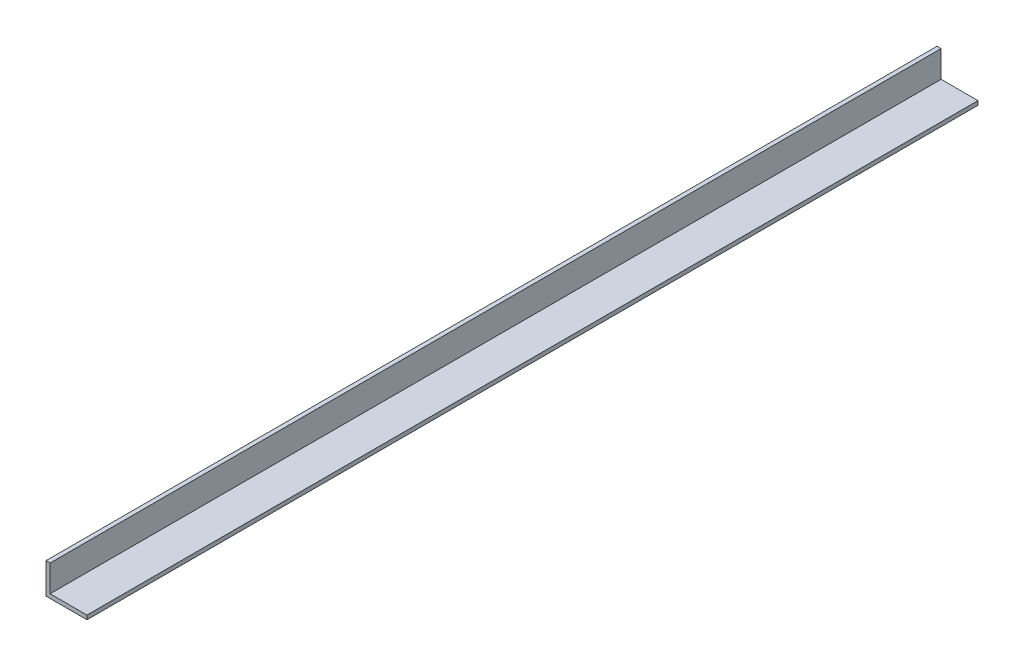
ISO-10303-21;
HEADER;
FILE_DESCRIPTION(('STEP AP214'),'2;1');
FILE_NAME('part.step','',(''),(''),'','','');
FILE_SCHEMA(('AUTOMOTIVE_DESIGN { 1 0 10303 214 1 1 1 1 }'));
ENDSEC;
DATA;
#1=APPLICATION_CONTEXT('core data for automotive mechanical design processes');
#2=APPLICATION_PROTOCOL_DEFINITION('international standard','automotive_design',2000,#1);
#3=PRODUCT_CONTEXT('',#1,'mechanical');
#4=PRODUCT('Part','Part','',(#3));
#5=PRODUCT_RELATED_PRODUCT_CATEGORY('part','',(#4));
#6=PRODUCT_DEFINITION_FORMATION('','',#4);
#7=PRODUCT_DEFINITION_CONTEXT('part definition',#1,'design');
#8=PRODUCT_DEFINITION('design','',#6,#7);
#9=PRODUCT_DEFINITION_SHAPE('','',#8);
#10=(LENGTH_UNIT() NAMED_UNIT(*) SI_UNIT(.MILLI.,.METRE.));
#11=(NAMED_UNIT(*) PLANE_ANGLE_UNIT() SI_UNIT($,.RADIAN.));
#12=(NAMED_UNIT(*) SI_UNIT($,.STERADIAN.) SOLID_ANGLE_UNIT());
#13=UNCERTAINTY_MEASURE_WITH_UNIT(LENGTH_MEASURE(1.E-05),#10,'distance_accuracy_value','');
#14=(GEOMETRIC_REPRESENTATION_CONTEXT(3) GLOBAL_UNCERTAINTY_ASSIGNED_CONTEXT((#13)) GLOBAL_UNIT_ASSIGNED_CONTEXT((#10,
#11,#12)) REPRESENTATION_CONTEXT('',''));
#15=CARTESIAN_POINT('',(0.,0.,0.));
#16=DIRECTION('',(0.,0.,1.));
#17=DIRECTION('',(1.,0.,0.));
#18=AXIS2_PLACEMENT_3D('',#15,#16,#17);
#19=CARTESIAN_POINT('',(0.,15.,217.5));
#20=DIRECTION('',(0.,-1.,0.));
#21=DIRECTION('',(0.,0.,-1.));
#22=AXIS2_PLACEMENT_3D('',#19,#20,#21);
#23=PLANE('',#22);
#24=DIRECTION('',(-1.,0.,0.));
#25=VECTOR('',#24,1.);
#26=CARTESIAN_POINT('',(0.,15.,-217.5));
#27=LINE('',#26,#25);
#28=CARTESIAN_POINT('',(2.,15.,-217.5));
#29=VERTEX_POINT('',#28);
#30=CARTESIAN_POINT('',(0.,15.,-217.5));
#31=VERTEX_POINT('',#30);
#32=EDGE_CURVE('E119',#29,#31,#27,.T.);
#33=ORIENTED_EDGE('',*,*,#32,.T.);
#34=DIRECTION('',(0.,0.,-1.));
#35=VECTOR('',#34,1.);
#36=CARTESIAN_POINT('',(0.,15.,217.5));
#37=LINE('',#36,#35);
#38=CARTESIAN_POINT('',(0.,15.,217.5));
#39=VERTEX_POINT('',#38);
#40=EDGE_CURVE('E11',#39,#31,#37,.T.);
#41=ORIENTED_EDGE('',*,*,#40,.F.);
#42=DIRECTION('',(-1.,0.,0.));
#43=VECTOR('',#42,1.);
#44=CARTESIAN_POINT('',(0.,15.,217.5));
#45=LINE('',#44,#43);
#46=CARTESIAN_POINT('',(2.,15.,217.5));
#47=VERTEX_POINT('',#46);
#48=EDGE_CURVE('E129',#47,#39,#45,.T.);
#49=ORIENTED_EDGE('',*,*,#48,.F.);
#50=DIRECTION('',(0.,0.,-1.));
#51=VECTOR('',#50,1.);
#52=CARTESIAN_POINT('',(2.,15.,217.5));
#53=LINE('',#52,#51);
#54=EDGE_CURVE('E115',#47,#29,#53,.T.);
#55=ORIENTED_EDGE('',*,*,#54,.T.);
#56=EDGE_LOOP('',(#33,#41,#49,#55));
#57=FACE_BOUND('',#56,.T.);
#58=ADVANCED_FACE('F35',(#57),#23,.F.);
#59=CARTESIAN_POINT('',(0.,15.,217.5));
#60=DIRECTION('',(1.,0.,0.));
#61=DIRECTION('',(0.,1.,0.));
#62=AXIS2_PLACEMENT_3D('',#59,#60,#61);
#63=PLANE('',#62);
#64=DIRECTION('',(0.,-1.,0.));
#65=VECTOR('',#64,1.);
#66=CARTESIAN_POINT('',(0.,15.,-217.5));
#67=LINE('',#66,#65);
#68=CARTESIAN_POINT('',(0.,0.,-217.5));
#69=VERTEX_POINT('',#68);
#70=EDGE_CURVE('E122',#31,#69,#67,.T.);
#71=ORIENTED_EDGE('',*,*,#70,.T.);
#72=DIRECTION('',(0.,0.,-1.));
#73=VECTOR('',#72,1.);
#74=CARTESIAN_POINT('',(0.,0.,217.5));
#75=LINE('',#74,#73);
#76=CARTESIAN_POINT('',(0.,0.,217.5));
#77=VERTEX_POINT('',#76);
#78=EDGE_CURVE('E43',#77,#69,#75,.T.);
#79=ORIENTED_EDGE('',*,*,#78,.F.);
#80=DIRECTION('',(0.,-1.,0.));
#81=VECTOR('',#80,1.);
#82=CARTESIAN_POINT('',(0.,15.,217.5));
#83=LINE('',#82,#81);
#84=EDGE_CURVE('E88',#39,#77,#83,.T.);
#85=ORIENTED_EDGE('',*,*,#84,.F.);
#86=ORIENTED_EDGE('',*,*,#40,.T.);
#87=EDGE_LOOP('',(#71,#79,#85,#86));
#88=FACE_BOUND('',#87,.T.);
#89=ADVANCED_FACE('F153',(#88),#63,.F.);
#90=CARTESIAN_POINT('',(0.,0.,217.5));
#91=DIRECTION('',(0.,1.,0.));
#92=DIRECTION('',(0.,0.,1.));
#93=AXIS2_PLACEMENT_3D('',#90,#91,#92);
#94=PLANE('',#93);
#95=DIRECTION('',(1.,0.,0.));
#96=VECTOR('',#95,1.);
#97=CARTESIAN_POINT('',(0.,0.,-217.5));
#98=LINE('',#97,#96);
#99=CARTESIAN_POINT('',(20.,0.,-217.5));
#100=VERTEX_POINT('',#99);
#101=EDGE_CURVE('E124',#69,#100,#98,.T.);
#102=ORIENTED_EDGE('',*,*,#101,.T.);
#103=DIRECTION('',(0.,0.,-1.));
#104=VECTOR('',#103,1.);
#105=CARTESIAN_POINT('',(20.,0.,217.5));
#106=LINE('',#105,#104);
#107=CARTESIAN_POINT('',(20.,0.,217.5));
#108=VERTEX_POINT('',#107);
#109=EDGE_CURVE('E110',#108,#100,#106,.T.);
#110=ORIENTED_EDGE('',*,*,#109,.F.);
#111=DIRECTION('',(1.,0.,0.));
#112=VECTOR('',#111,1.);
#113=CARTESIAN_POINT('',(0.,0.,217.5));
#114=LINE('',#113,#112);
#115=EDGE_CURVE('E101',#77,#108,#114,.T.);
#116=ORIENTED_EDGE('',*,*,#115,.F.);
#117=ORIENTED_EDGE('',*,*,#78,.T.);
#118=EDGE_LOOP('',(#102,#110,#116,#117));
#119=FACE_BOUND('',#118,.T.);
#120=ADVANCED_FACE('F135',(#119),#94,.F.);
#121=CARTESIAN_POINT('',(20.,0.,217.5));
#122=DIRECTION('',(-1.,0.,0.));
#123=DIRECTION('',(0.,0.,1.));
#124=AXIS2_PLACEMENT_3D('',#121,#122,#123);
#125=PLANE('',#124);
#126=DIRECTION('',(0.,1.,0.));
#127=VECTOR('',#126,1.);
#128=CARTESIAN_POINT('',(20.,0.,-217.5));
#129=LINE('',#128,#127);
#130=CARTESIAN_POINT('',(20.,2.,-217.5));
#131=VERTEX_POINT('',#130);
#132=EDGE_CURVE('E109',#100,#131,#129,.T.);
#133=ORIENTED_EDGE('',*,*,#132,.T.);
#134=DIRECTION('',(0.,0.,-1.));
#135=VECTOR('',#134,1.);
#136=CARTESIAN_POINT('',(20.,2.,217.5));
#137=LINE('',#136,#135);
#138=CARTESIAN_POINT('',(20.,2.,217.5));
#139=VERTEX_POINT('',#138);
#140=EDGE_CURVE('E106',#139,#131,#137,.T.);
#141=ORIENTED_EDGE('',*,*,#140,.F.);
#142=DIRECTION('',(0.,1.,0.));
#143=VECTOR('',#142,1.);
#144=CARTESIAN_POINT('',(20.,0.,217.5));
#145=LINE('',#144,#143);
#146=EDGE_CURVE('E95',#108,#139,#145,.T.);
#147=ORIENTED_EDGE('',*,*,#146,.F.);
#148=ORIENTED_EDGE('',*,*,#109,.T.);
#149=EDGE_LOOP('',(#133,#141,#147,#148));
#150=FACE_BOUND('',#149,.T.);
#151=ADVANCED_FACE('F107',(#150),#125,.F.);
#152=CARTESIAN_POINT('',(20.,2.,217.5));
#153=DIRECTION('',(0.,-1.,0.));
#154=DIRECTION('',(1.,0.,0.));
#155=AXIS2_PLACEMENT_3D('',#152,#153,#154);
#156=PLANE('',#155);
#157=DIRECTION('',(-1.,0.,0.));
#158=VECTOR('',#157,1.);
#159=CARTESIAN_POINT('',(20.,2.,-217.5));
#160=LINE('',#159,#158);
#161=CARTESIAN_POINT('',(2.,2.,-217.5));
#162=VERTEX_POINT('',#161);
#163=EDGE_CURVE('E74',#131,#162,#160,.T.);
#164=ORIENTED_EDGE('',*,*,#163,.T.);
#165=DIRECTION('',(0.,0.,-1.));
#166=VECTOR('',#165,1.);
#167=CARTESIAN_POINT('',(2.,2.,217.5));
#168=LINE('',#167,#166);
#169=CARTESIAN_POINT('',(2.,2.,217.5));
#170=VERTEX_POINT('',#169);
#171=EDGE_CURVE('E111',#170,#162,#168,.T.);
#172=ORIENTED_EDGE('',*,*,#171,.F.);
#173=DIRECTION('',(-1.,0.,0.));
#174=VECTOR('',#173,1.);
#175=CARTESIAN_POINT('',(20.,2.,217.5));
#176=LINE('',#175,#174);
#177=EDGE_CURVE('E99',#139,#170,#176,.T.);
#178=ORIENTED_EDGE('',*,*,#177,.F.);
#179=ORIENTED_EDGE('',*,*,#140,.T.);
#180=EDGE_LOOP('',(#164,#172,#178,#179));
#181=FACE_BOUND('',#180,.T.);
#182=ADVANCED_FACE('F113',(#181),#156,.F.);
#183=CARTESIAN_POINT('',(2.,2.,217.5));
#184=DIRECTION('',(-1.,0.,0.));
#185=DIRECTION('',(0.,-1.,0.));
#186=AXIS2_PLACEMENT_3D('',#183,#184,#185);
#187=PLANE('',#186);
#188=DIRECTION('',(0.,1.,0.));
#189=VECTOR('',#188,1.);
#190=CARTESIAN_POINT('',(2.,2.,-217.5));
#191=LINE('',#190,#189);
#192=EDGE_CURVE('E80',#162,#29,#191,.T.);
#193=ORIENTED_EDGE('',*,*,#192,.T.);
#194=ORIENTED_EDGE('',*,*,#54,.F.);
#195=DIRECTION('',(0.,1.,0.));
#196=VECTOR('',#195,1.);
#197=CARTESIAN_POINT('',(2.,2.,217.5));
#198=LINE('',#197,#196);
#199=EDGE_CURVE('E51',#170,#47,#198,.T.);
#200=ORIENTED_EDGE('',*,*,#199,.F.);
#201=ORIENTED_EDGE('',*,*,#171,.T.);
#202=EDGE_LOOP('',(#193,#194,#200,#201));
#203=FACE_BOUND('',#202,.T.);
#204=ADVANCED_FACE('F142',(#203),#187,.F.);
#205=CARTESIAN_POINT('',(0.,0.,217.5));
#206=DIRECTION('',(0.,0.,1.));
#207=DIRECTION('',(1.,0.,0.));
#208=AXIS2_PLACEMENT_3D('',#205,#206,#207);
#209=PLANE('',#208);
#210=ORIENTED_EDGE('',*,*,#48,.T.);
#211=ORIENTED_EDGE('',*,*,#84,.T.);
#212=ORIENTED_EDGE('',*,*,#115,.T.);
#213=ORIENTED_EDGE('',*,*,#146,.T.);
#214=ORIENTED_EDGE('',*,*,#177,.T.);
#215=ORIENTED_EDGE('',*,*,#199,.T.);
#216=EDGE_LOOP('',(#210,#211,#212,#213,#214,#215));
#217=FACE_BOUND('',#216,.T.);
#218=ADVANCED_FACE('F97',(#217),#209,.T.);
#219=CARTESIAN_POINT('',(0.,0.,-217.5));
#220=DIRECTION('',(0.,0.,1.));
#221=DIRECTION('',(1.,0.,0.));
#222=AXIS2_PLACEMENT_3D('',#219,#220,#221);
#223=PLANE('',#222);
#224=ORIENTED_EDGE('',*,*,#32,.F.);
#225=ORIENTED_EDGE('',*,*,#192,.F.);
#226=ORIENTED_EDGE('',*,*,#163,.F.);
#227=ORIENTED_EDGE('',*,*,#132,.F.);
#228=ORIENTED_EDGE('',*,*,#101,.F.);
#229=ORIENTED_EDGE('',*,*,#70,.F.);
#230=EDGE_LOOP('',(#224,#225,#226,#227,#228,#229));
#231=FACE_BOUND('',#230,.T.);
#232=ADVANCED_FACE('F138',(#231),#223,.F.);
#233=CLOSED_SHELL('',(#58,#89,#120,#151,#182,#204,#218,#232));
#234=MANIFOLD_SOLID_BREP('B2',#233);
#235=ADVANCED_BREP_SHAPE_REPRESENTATION('',(#18,#234),#14);
#236=SHAPE_DEFINITION_REPRESENTATION(#9,#235);
ENDSEC;
END-ISO-10303-21;
